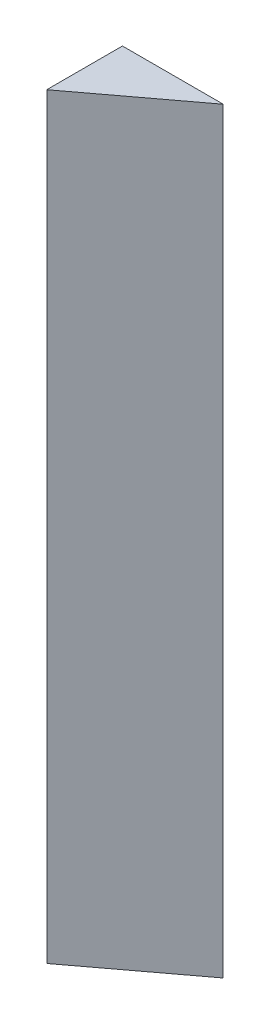
ISO-10303-21;
HEADER;
FILE_DESCRIPTION(('STEP AP214'),'2;1');
FILE_NAME('part.step','',(''),(''),'','','');
FILE_SCHEMA(('AUTOMOTIVE_DESIGN { 1 0 10303 214 1 1 1 1 }'));
ENDSEC;
DATA;
#1=APPLICATION_CONTEXT('core data for automotive mechanical design processes');
#2=APPLICATION_PROTOCOL_DEFINITION('international standard','automotive_design',2000,#1);
#3=PRODUCT_CONTEXT('',#1,'mechanical');
#4=PRODUCT('Part','Part','',(#3));
#5=PRODUCT_RELATED_PRODUCT_CATEGORY('part','',(#4));
#6=PRODUCT_DEFINITION_FORMATION('','',#4);
#7=PRODUCT_DEFINITION_CONTEXT('part definition',#1,'design');
#8=PRODUCT_DEFINITION('design','',#6,#7);
#9=PRODUCT_DEFINITION_SHAPE('','',#8);
#10=(LENGTH_UNIT() NAMED_UNIT(*) SI_UNIT(.MILLI.,.METRE.));
#11=(NAMED_UNIT(*) PLANE_ANGLE_UNIT() SI_UNIT($,.RADIAN.));
#12=(NAMED_UNIT(*) SI_UNIT($,.STERADIAN.) SOLID_ANGLE_UNIT());
#13=UNCERTAINTY_MEASURE_WITH_UNIT(LENGTH_MEASURE(1.E-05),#10,'distance_accuracy_value','');
#14=(GEOMETRIC_REPRESENTATION_CONTEXT(3) GLOBAL_UNCERTAINTY_ASSIGNED_CONTEXT((#13)) GLOBAL_UNIT_ASSIGNED_CONTEXT((#10,
#11,#12)) REPRESENTATION_CONTEXT('',''));
#15=CARTESIAN_POINT('',(0.,0.,0.));
#16=DIRECTION('',(0.,0.,1.));
#17=DIRECTION('',(1.,0.,0.));
#18=AXIS2_PLACEMENT_3D('',#15,#16,#17);
#19=CARTESIAN_POINT('',(-3.90666123986714,-0.74999902028157,-2.35778256416104));
#20=DIRECTION('',(-1.74845553146952E-07,-1.,8.74227765734759E-08));
#21=DIRECTION('',(1.,-1.74845553146952E-07,0.));
#22=AXIS2_PLACEMENT_3D('',#19,#20,#21);
#23=PLANE('',#22);
#24=DIRECTION('',(0.999999999999985,-1.74845553322983E-07,0.));
#25=VECTOR('',#24,1.);
#26=CARTESIAN_POINT('',(-3.90000013113414,-0.749999020863902,-2.35112145542904));
#27=LINE('',#26,#25);
#28=CARTESIAN_POINT('',(-3.90000013113414,-0.749999020865902,-2.35112145542904));
#29=VERTEX_POINT('',#28);
#30=CARTESIAN_POINT('',(-3.76677795649014,-0.749999044159207,-2.35112145542904));
#31=VERTEX_POINT('',#30);
#32=EDGE_CURVE('E11',#29,#31,#27,.T.);
#33=ORIENTED_EDGE('',*,*,#32,.F.);
#34=DIRECTION('',(0.,-8.74227767955197E-08,-0.999999999999996));
#35=VECTOR('',#34,1.);
#36=CARTESIAN_POINT('',(-3.90000013113414,-0.749999012121625,-2.25112145542904));
#37=LINE('',#36,#35);
#38=CARTESIAN_POINT('',(-3.90000013113414,-0.749999012123625,-2.25112145542904));
#39=VERTEX_POINT('',#38);
#40=EDGE_CURVE('E63',#39,#29,#37,.T.);
#41=ORIENTED_EDGE('',*,*,#40,.F.);
#42=DIRECTION('',(-0.799759704949023,1.92316092216546E-07,0.600320259811223));
#43=VECTOR('',#42,1.);
#44=CARTESIAN_POINT('',(-3.76677795649014,-0.749999044157207,-2.35112145542904));
#45=LINE('',#44,#43);
#46=EDGE_CURVE('E70',#31,#39,#45,.T.);
#47=ORIENTED_EDGE('',*,*,#46,.F.);
#48=EDGE_LOOP('',(#33,#41,#47));
#49=FACE_BOUND('',#48,.T.);
#50=ADVANCED_FACE('F17',(#49),#23,.F.);
#51=CARTESIAN_POINT('',(-3.90666141471269,-1.74999902028257,-2.35778247673826));
#52=DIRECTION('',(-1.74845553146952E-07,-1.,8.74227765734759E-08));
#53=DIRECTION('',(1.,-1.74845553146952E-07,0.));
#54=AXIS2_PLACEMENT_3D('',#51,#52,#53);
#55=PLANE('',#54);
#56=DIRECTION('',(-0.799759704949023,1.92316091550056E-07,0.600320259811223));
#57=VECTOR('',#56,1.);
#58=CARTESIAN_POINT('',(-3.76677813133569,-1.74999904415821,-2.35112136800626));
#59=LINE('',#58,#57);
#60=CARTESIAN_POINT('',(-3.76677813133569,-1.74999904415721,-2.35112136800626));
#61=VERTEX_POINT('',#60);
#62=CARTESIAN_POINT('',(-3.90000030597969,-1.74999901212162,-2.25112136800626));
#63=VERTEX_POINT('',#62);
#64=EDGE_CURVE('E24',#61,#63,#59,.T.);
#65=ORIENTED_EDGE('',*,*,#64,.T.);
#66=DIRECTION('',(0.,-8.7422775685297E-08,-0.999999999999996));
#67=VECTOR('',#66,1.);
#68=CARTESIAN_POINT('',(-3.90000030597969,-1.74999901212262,-2.25112136800626));
#69=LINE('',#68,#67);
#70=CARTESIAN_POINT('',(-3.90000030597969,-1.7499990208639,-2.35112136800626));
#71=VERTEX_POINT('',#70);
#72=EDGE_CURVE('E49',#63,#71,#69,.T.);
#73=ORIENTED_EDGE('',*,*,#72,.T.);
#74=DIRECTION('',(0.999999999999985,-1.74845553322982E-07,0.));
#75=VECTOR('',#74,1.);
#76=CARTESIAN_POINT('',(-3.90000030597969,-1.7499990208649,-2.35112136800626));
#77=LINE('',#76,#75);
#78=EDGE_CURVE('E46',#71,#61,#77,.T.);
#79=ORIENTED_EDGE('',*,*,#78,.T.);
#80=EDGE_LOOP('',(#65,#73,#79));
#81=FACE_BOUND('',#80,.T.);
#82=ADVANCED_FACE('F47',(#81),#55,.T.);
#83=CARTESIAN_POINT('',(-3.76677795649014,-0.749999044157207,-2.35112145542904));
#84=DIRECTION('',(0.600320259811241,-3.50461138937884E-08,0.799759704949042));
#85=DIRECTION('',(-0.799759704949033,1.92316091942466E-07,0.600320259811229));
#86=AXIS2_PLACEMENT_3D('',#83,#84,#85);
#87=PLANE('',#86);
#88=ORIENTED_EDGE('',*,*,#46,.T.);
#89=DIRECTION('',(-1.74845553146774E-07,-0.999999999999981,8.74227765733868E-08));
#90=VECTOR('',#89,1.);
#91=CARTESIAN_POINT('',(-3.90000013113414,-0.749999012121625,-2.25112145542904));
#92=LINE('',#91,#90);
#93=EDGE_CURVE('E54',#39,#63,#92,.T.);
#94=ORIENTED_EDGE('',*,*,#93,.T.);
#95=ORIENTED_EDGE('',*,*,#64,.F.);
#96=DIRECTION('',(-1.74845553146774E-07,-0.999999999999981,8.74227765733868E-08));
#97=VECTOR('',#96,1.);
#98=CARTESIAN_POINT('',(-3.76677795649014,-0.749999044157207,-2.35112145542904));
#99=LINE('',#98,#97);
#100=EDGE_CURVE('E61',#31,#61,#99,.T.);
#101=ORIENTED_EDGE('',*,*,#100,.F.);
#102=EDGE_LOOP('',(#88,#94,#95,#101));
#103=FACE_BOUND('',#102,.T.);
#104=ADVANCED_FACE('F60',(#103),#87,.T.);
#105=CARTESIAN_POINT('',(-3.90000013113414,-0.749999012121625,-2.25112145542904));
#106=DIRECTION('',(-1.,1.74845553146952E-07,0.));
#107=DIRECTION('',(0.,-8.74227765734759E-08,-1.));
#108=AXIS2_PLACEMENT_3D('',#105,#106,#107);
#109=PLANE('',#108);
#110=ORIENTED_EDGE('',*,*,#40,.T.);
#111=DIRECTION('',(-1.74845553146774E-07,-0.999999999999981,8.74227765733868E-08));
#112=VECTOR('',#111,1.);
#113=CARTESIAN_POINT('',(-3.90000013113414,-0.749999020863902,-2.35112145542904));
#114=LINE('',#113,#112);
#115=EDGE_CURVE('E55',#29,#71,#114,.T.);
#116=ORIENTED_EDGE('',*,*,#115,.T.);
#117=ORIENTED_EDGE('',*,*,#72,.F.);
#118=ORIENTED_EDGE('',*,*,#93,.F.);
#119=EDGE_LOOP('',(#110,#116,#117,#118));
#120=FACE_BOUND('',#119,.T.);
#121=ADVANCED_FACE('F73',(#120),#109,.T.);
#122=CARTESIAN_POINT('',(-3.90000013113414,-0.749999020863903,-2.35112145542904));
#123=DIRECTION('',(0.,-8.74227765734759E-08,-1.));
#124=DIRECTION('',(1.,-1.74845553146952E-07,0.));
#125=AXIS2_PLACEMENT_3D('',#122,#123,#124);
#126=PLANE('',#125);
#127=ORIENTED_EDGE('',*,*,#32,.T.);
#128=ORIENTED_EDGE('',*,*,#100,.T.);
#129=ORIENTED_EDGE('',*,*,#78,.F.);
#130=ORIENTED_EDGE('',*,*,#115,.F.);
#131=EDGE_LOOP('',(#127,#128,#129,#130));
#132=FACE_BOUND('',#131,.T.);
#133=ADVANCED_FACE('F64',(#132),#126,.T.);
#134=CLOSED_SHELL('',(#50,#82,#104,#121,#133));
#135=MANIFOLD_SOLID_BREP('B1',#134);
#136=ADVANCED_BREP_SHAPE_REPRESENTATION('',(#18,#135),#14);
#137=SHAPE_DEFINITION_REPRESENTATION(#9,#136);
ENDSEC;
END-ISO-10303-21;
